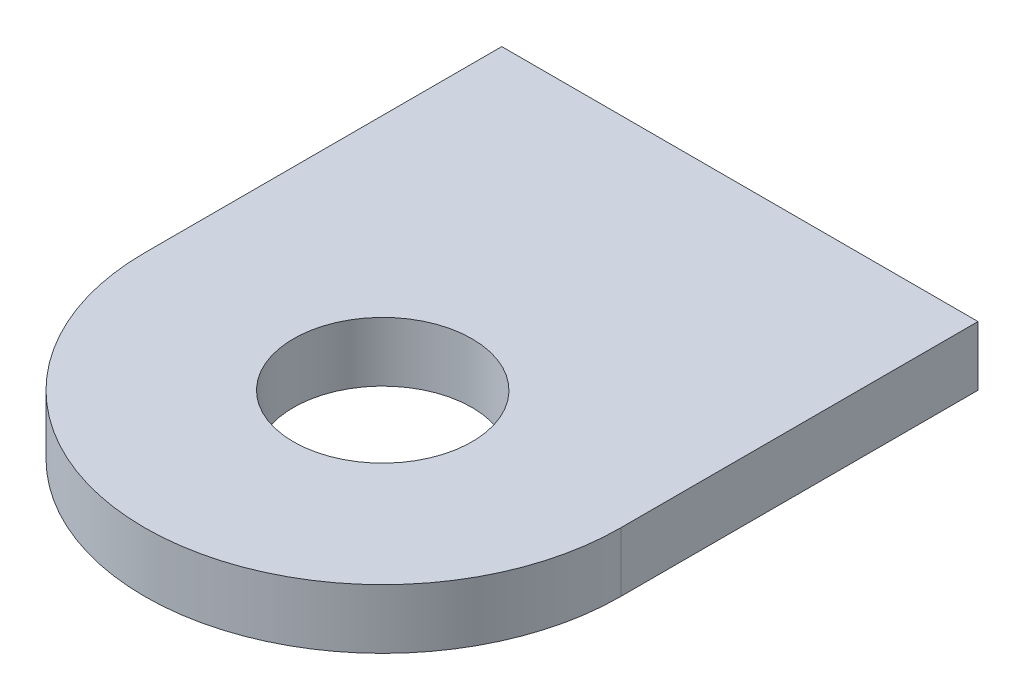
ISO-10303-21;
HEADER;
FILE_DESCRIPTION(('STEP AP214'),'2;1');
FILE_NAME('part.step','',(''),(''),'','','');
FILE_SCHEMA(('AUTOMOTIVE_DESIGN { 1 0 10303 214 1 1 1 1 }'));
ENDSEC;
DATA;
#1=APPLICATION_CONTEXT('core data for automotive mechanical design processes');
#2=APPLICATION_PROTOCOL_DEFINITION('international standard','automotive_design',2000,#1);
#3=PRODUCT_CONTEXT('',#1,'mechanical');
#4=PRODUCT('Part','Part','',(#3));
#5=PRODUCT_RELATED_PRODUCT_CATEGORY('part','',(#4));
#6=PRODUCT_DEFINITION_FORMATION('','',#4);
#7=PRODUCT_DEFINITION_CONTEXT('part definition',#1,'design');
#8=PRODUCT_DEFINITION('design','',#6,#7);
#9=PRODUCT_DEFINITION_SHAPE('','',#8);
#10=(LENGTH_UNIT() NAMED_UNIT(*) SI_UNIT(.MILLI.,.METRE.));
#11=(NAMED_UNIT(*) PLANE_ANGLE_UNIT() SI_UNIT($,.RADIAN.));
#12=(NAMED_UNIT(*) SI_UNIT($,.STERADIAN.) SOLID_ANGLE_UNIT());
#13=UNCERTAINTY_MEASURE_WITH_UNIT(LENGTH_MEASURE(1.E-05),#10,'distance_accuracy_value','');
#14=(GEOMETRIC_REPRESENTATION_CONTEXT(3) GLOBAL_UNCERTAINTY_ASSIGNED_CONTEXT((#13)) GLOBAL_UNIT_ASSIGNED_CONTEXT((#10,
#11,#12)) REPRESENTATION_CONTEXT('',''));
#15=CARTESIAN_POINT('',(0.,0.,0.));
#16=DIRECTION('',(0.,0.,1.));
#17=DIRECTION('',(1.,0.,0.));
#18=AXIS2_PLACEMENT_3D('',#15,#16,#17);
#19=CARTESIAN_POINT('',(0.,3.175,38.1));
#20=DIRECTION('',(0.,1.,0.));
#21=DIRECTION('',(0.,0.,1.));
#22=AXIS2_PLACEMENT_3D('',#19,#20,#21);
#23=PLANE('',#22);
#24=DIRECTION('',(-1.,0.,0.));
#25=VECTOR('',#24,1.);
#26=CARTESIAN_POINT('',(25.4,3.175,0.));
#27=LINE('',#26,#25);
#28=CARTESIAN_POINT('',(25.4,3.175,0.));
#29=VERTEX_POINT('',#28);
#30=CARTESIAN_POINT('',(-25.4,3.175,0.));
#31=VERTEX_POINT('',#30);
#32=EDGE_CURVE('E83',#29,#31,#27,.T.);
#33=ORIENTED_EDGE('',*,*,#32,.T.);
#34=DIRECTION('',(0.,0.,1.));
#35=VECTOR('',#34,1.);
#36=CARTESIAN_POINT('',(-25.4,3.175,0.));
#37=LINE('',#36,#35);
#38=CARTESIAN_POINT('',(-25.4,3.175,38.1));
#39=VERTEX_POINT('',#38);
#40=EDGE_CURVE('E78',#31,#39,#37,.T.);
#41=ORIENTED_EDGE('',*,*,#40,.T.);
#42=CARTESIAN_POINT('',(0.,3.175,38.1));
#43=DIRECTION('',(0.,1.,0.));
#44=DIRECTION('',(0.,0.,1.));
#45=AXIS2_PLACEMENT_3D('',#42,#43,#44);
#46=CIRCLE('',#45,25.4);
#47=CARTESIAN_POINT('',(25.4,3.175,38.1));
#48=VERTEX_POINT('',#47);
#49=EDGE_CURVE('E81',#39,#48,#46,.T.);
#50=ORIENTED_EDGE('',*,*,#49,.T.);
#51=DIRECTION('',(0.,0.,-1.));
#52=VECTOR('',#51,1.);
#53=CARTESIAN_POINT('',(25.4,3.175,38.1));
#54=LINE('',#53,#52);
#55=EDGE_CURVE('E48',#48,#29,#54,.T.);
#56=ORIENTED_EDGE('',*,*,#55,.T.);
#57=EDGE_LOOP('',(#33,#41,#50,#56));
#58=FACE_BOUND('',#57,.T.);
#59=CARTESIAN_POINT('',(0.,3.175,38.1));
#60=DIRECTION('',(0.,1.,0.));
#61=DIRECTION('',(0.,0.,1.));
#62=AXIS2_PLACEMENT_3D('',#59,#60,#61);
#63=CIRCLE('',#62,9.525);
#64=CARTESIAN_POINT('',(0.,3.175,47.625));
#65=VERTEX_POINT('',#64);
#66=EDGE_CURVE('E98',#65,#65,#63,.T.);
#67=ORIENTED_EDGE('',*,*,#66,.F.);
#68=EDGE_LOOP('',(#67));
#69=FACE_BOUND('',#68,.T.);
#70=ADVANCED_FACE('F31',(#58,#69),#23,.T.);
#71=CARTESIAN_POINT('',(0.,-3.175,38.1));
#72=DIRECTION('',(0.,1.,0.));
#73=DIRECTION('',(0.,0.,1.));
#74=AXIS2_PLACEMENT_3D('',#71,#72,#73);
#75=PLANE('',#74);
#76=DIRECTION('',(-1.,0.,0.));
#77=VECTOR('',#76,1.);
#78=CARTESIAN_POINT('',(25.4,-3.175,0.));
#79=LINE('',#78,#77);
#80=CARTESIAN_POINT('',(25.4,-3.175,0.));
#81=VERTEX_POINT('',#80);
#82=CARTESIAN_POINT('',(-25.4,-3.175,0.));
#83=VERTEX_POINT('',#82);
#84=EDGE_CURVE('E95',#81,#83,#79,.T.);
#85=ORIENTED_EDGE('',*,*,#84,.F.);
#86=DIRECTION('',(0.,0.,-1.));
#87=VECTOR('',#86,1.);
#88=CARTESIAN_POINT('',(25.4,-3.175,38.1));
#89=LINE('',#88,#87);
#90=CARTESIAN_POINT('',(25.4,-3.175,38.1));
#91=VERTEX_POINT('',#90);
#92=EDGE_CURVE('E71',#91,#81,#89,.T.);
#93=ORIENTED_EDGE('',*,*,#92,.F.);
#94=CARTESIAN_POINT('',(0.,-3.175,38.1));
#95=DIRECTION('',(0.,1.,0.));
#96=DIRECTION('',(0.,0.,1.));
#97=AXIS2_PLACEMENT_3D('',#94,#95,#96);
#98=CIRCLE('',#97,25.4);
#99=CARTESIAN_POINT('',(-25.4,-3.175,38.1));
#100=VERTEX_POINT('',#99);
#101=EDGE_CURVE('E65',#100,#91,#98,.T.);
#102=ORIENTED_EDGE('',*,*,#101,.F.);
#103=DIRECTION('',(0.,0.,1.));
#104=VECTOR('',#103,1.);
#105=CARTESIAN_POINT('',(-25.4,-3.175,0.));
#106=LINE('',#105,#104);
#107=EDGE_CURVE('E87',#83,#100,#106,.T.);
#108=ORIENTED_EDGE('',*,*,#107,.F.);
#109=EDGE_LOOP('',(#85,#93,#102,#108));
#110=FACE_BOUND('',#109,.T.);
#111=CARTESIAN_POINT('',(0.,-3.175,38.1));
#112=DIRECTION('',(0.,1.,0.));
#113=DIRECTION('',(0.,0.,1.));
#114=AXIS2_PLACEMENT_3D('',#111,#112,#113);
#115=CIRCLE('',#114,9.525);
#116=CARTESIAN_POINT('',(0.,-3.175,47.625));
#117=VERTEX_POINT('',#116);
#118=EDGE_CURVE('E110',#117,#117,#115,.T.);
#119=ORIENTED_EDGE('',*,*,#118,.T.);
#120=EDGE_LOOP('',(#119));
#121=FACE_BOUND('',#120,.T.);
#122=ADVANCED_FACE('F106',(#110,#121),#75,.F.);
#123=CARTESIAN_POINT('',(25.4,3.175,0.));
#124=DIRECTION('',(0.,0.,1.));
#125=DIRECTION('',(1.,0.,0.));
#126=AXIS2_PLACEMENT_3D('',#123,#124,#125);
#127=PLANE('',#126);
#128=ORIENTED_EDGE('',*,*,#84,.T.);
#129=DIRECTION('',(0.,-1.,0.));
#130=VECTOR('',#129,1.);
#131=CARTESIAN_POINT('',(-25.4,3.175,0.));
#132=LINE('',#131,#130);
#133=EDGE_CURVE('E11',#31,#83,#132,.T.);
#134=ORIENTED_EDGE('',*,*,#133,.F.);
#135=ORIENTED_EDGE('',*,*,#32,.F.);
#136=DIRECTION('',(0.,-1.,0.));
#137=VECTOR('',#136,1.);
#138=CARTESIAN_POINT('',(25.4,3.175,0.));
#139=LINE('',#138,#137);
#140=EDGE_CURVE('E91',#29,#81,#139,.T.);
#141=ORIENTED_EDGE('',*,*,#140,.T.);
#142=EDGE_LOOP('',(#128,#134,#135,#141));
#143=FACE_BOUND('',#142,.T.);
#144=ADVANCED_FACE('F33',(#143),#127,.F.);
#145=CARTESIAN_POINT('',(-25.4,3.175,0.));
#146=DIRECTION('',(1.,0.,0.));
#147=DIRECTION('',(0.,0.,-1.));
#148=AXIS2_PLACEMENT_3D('',#145,#146,#147);
#149=PLANE('',#148);
#150=ORIENTED_EDGE('',*,*,#107,.T.);
#151=DIRECTION('',(0.,-1.,0.));
#152=VECTOR('',#151,1.);
#153=CARTESIAN_POINT('',(-25.4,3.175,38.1));
#154=LINE('',#153,#152);
#155=EDGE_CURVE('E40',#39,#100,#154,.T.);
#156=ORIENTED_EDGE('',*,*,#155,.F.);
#157=ORIENTED_EDGE('',*,*,#40,.F.);
#158=ORIENTED_EDGE('',*,*,#133,.T.);
#159=EDGE_LOOP('',(#150,#156,#157,#158));
#160=FACE_BOUND('',#159,.T.);
#161=ADVANCED_FACE('F86',(#160),#149,.F.);
#162=CARTESIAN_POINT('',(0.,3.175,38.1));
#163=DIRECTION('',(0.,-1.,0.));
#164=DIRECTION('',(0.,0.,-1.));
#165=AXIS2_PLACEMENT_3D('',#162,#163,#164);
#166=CYLINDRICAL_SURFACE('',#165,25.4);
#167=ORIENTED_EDGE('',*,*,#101,.T.);
#168=DIRECTION('',(0.,-1.,0.));
#169=VECTOR('',#168,1.);
#170=CARTESIAN_POINT('',(25.4,3.175,38.1));
#171=LINE('',#170,#169);
#172=EDGE_CURVE('E88',#48,#91,#171,.T.);
#173=ORIENTED_EDGE('',*,*,#172,.F.);
#174=ORIENTED_EDGE('',*,*,#49,.F.);
#175=ORIENTED_EDGE('',*,*,#155,.T.);
#176=EDGE_LOOP('',(#167,#173,#174,#175));
#177=FACE_BOUND('',#176,.T.);
#178=ADVANCED_FACE('F89',(#177),#166,.T.);
#179=CARTESIAN_POINT('',(25.4,3.175,38.1));
#180=DIRECTION('',(-1.,0.,0.));
#181=DIRECTION('',(0.,0.,1.));
#182=AXIS2_PLACEMENT_3D('',#179,#180,#181);
#183=PLANE('',#182);
#184=ORIENTED_EDGE('',*,*,#92,.T.);
#185=ORIENTED_EDGE('',*,*,#140,.F.);
#186=ORIENTED_EDGE('',*,*,#55,.F.);
#187=ORIENTED_EDGE('',*,*,#172,.T.);
#188=EDGE_LOOP('',(#184,#185,#186,#187));
#189=FACE_BOUND('',#188,.T.);
#190=ADVANCED_FACE('F103',(#189),#183,.F.);
#191=CARTESIAN_POINT('',(0.,3.175,38.1));
#192=DIRECTION('',(0.,-1.,0.));
#193=DIRECTION('',(0.,0.,-1.));
#194=AXIS2_PLACEMENT_3D('',#191,#192,#193);
#195=CYLINDRICAL_SURFACE('',#194,9.525);
#196=ORIENTED_EDGE('',*,*,#66,.T.);
#197=EDGE_LOOP('',(#196));
#198=FACE_BOUND('',#197,.T.);
#199=ORIENTED_EDGE('',*,*,#118,.F.);
#200=EDGE_LOOP('',(#199));
#201=FACE_BOUND('',#200,.T.);
#202=ADVANCED_FACE('F116',(#198,#201),#195,.F.);
#203=CLOSED_SHELL('',(#70,#122,#144,#161,#178,#190,#202));
#204=MANIFOLD_SOLID_BREP('B2',#203);
#205=ADVANCED_BREP_SHAPE_REPRESENTATION('',(#18,#204),#14);
#206=SHAPE_DEFINITION_REPRESENTATION(#9,#205);
ENDSEC;
END-ISO-10303-21;
